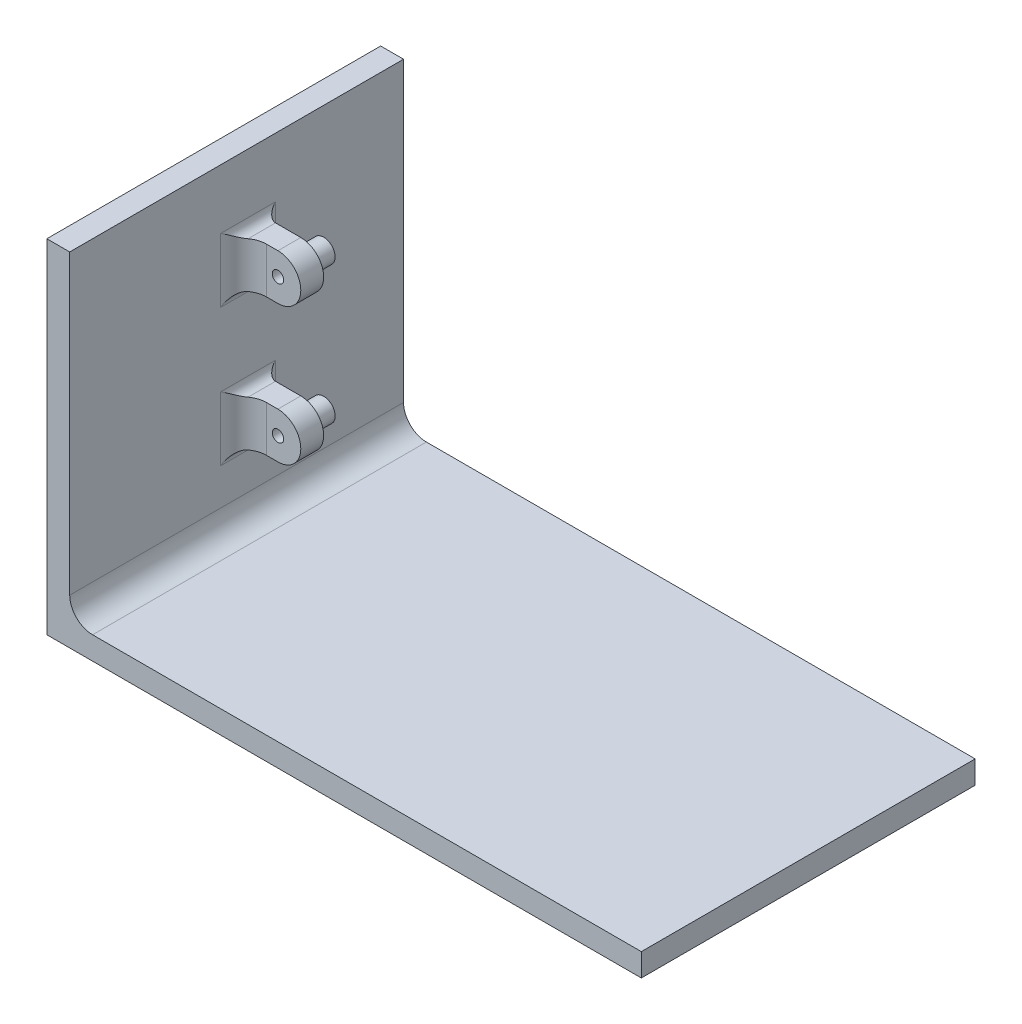
ISO-10303-21;
HEADER;
FILE_DESCRIPTION(('STEP AP214'),'2;1');
FILE_NAME('part.step','',(''),(''),'','','');
FILE_SCHEMA(('AUTOMOTIVE_DESIGN { 1 0 10303 214 1 1 1 1 }'));
ENDSEC;
DATA;
#1=APPLICATION_CONTEXT('core data for automotive mechanical design processes');
#2=APPLICATION_PROTOCOL_DEFINITION('international standard','automotive_design',2000,#1);
#3=PRODUCT_CONTEXT('',#1,'mechanical');
#4=PRODUCT('Part','Part','',(#3));
#5=PRODUCT_RELATED_PRODUCT_CATEGORY('part','',(#4));
#6=PRODUCT_DEFINITION_FORMATION('','',#4);
#7=PRODUCT_DEFINITION_CONTEXT('part definition',#1,'design');
#8=PRODUCT_DEFINITION('design','',#6,#7);
#9=PRODUCT_DEFINITION_SHAPE('','',#8);
#10=(LENGTH_UNIT() NAMED_UNIT(*) SI_UNIT(.MILLI.,.METRE.));
#11=(NAMED_UNIT(*) PLANE_ANGLE_UNIT() SI_UNIT($,.RADIAN.));
#12=(NAMED_UNIT(*) SI_UNIT($,.STERADIAN.) SOLID_ANGLE_UNIT());
#13=UNCERTAINTY_MEASURE_WITH_UNIT(LENGTH_MEASURE(1.E-05),#10,'distance_accuracy_value','');
#14=(GEOMETRIC_REPRESENTATION_CONTEXT(3) GLOBAL_UNCERTAINTY_ASSIGNED_CONTEXT((#13)) GLOBAL_UNIT_ASSIGNED_CONTEXT((#10,
#11,#12)) REPRESENTATION_CONTEXT('',''));
#15=CARTESIAN_POINT('',(0.,0.,0.));
#16=DIRECTION('',(0.,0.,1.));
#17=DIRECTION('',(1.,0.,0.));
#18=AXIS2_PLACEMENT_3D('',#15,#16,#17);
#19=CARTESIAN_POINT('',(0.,0.,73.));
#20=DIRECTION('',(0.,0.,1.));
#21=DIRECTION('',(1.,0.,0.));
#22=AXIS2_PLACEMENT_3D('',#19,#20,#21);
#23=PLANE('',#22);
#24=DIRECTION('',(1.,0.,0.));
#25=VECTOR('',#24,1.);
#26=CARTESIAN_POINT('',(0.,0.,73.));
#27=LINE('',#26,#25);
#28=CARTESIAN_POINT('',(5.,0.,73.));
#29=VERTEX_POINT('',#28);
#30=CARTESIAN_POINT('',(125.,0.,73.));
#31=VERTEX_POINT('',#30);
#32=EDGE_CURVE('E207',#29,#31,#27,.T.);
#33=ORIENTED_EDGE('',*,*,#32,.F.);
#34=CARTESIAN_POINT('',(5.,5.,73.));
#35=DIRECTION('',(0.,0.,1.));
#36=DIRECTION('',(1.,0.,0.));
#37=AXIS2_PLACEMENT_3D('',#34,#35,#36);
#38=CIRCLE('',#37,5.);
#39=CARTESIAN_POINT('',(0.,5.,73.));
#40=VERTEX_POINT('',#39);
#41=EDGE_CURVE('E190',#29,#40,#38,.F.);
#42=ORIENTED_EDGE('',*,*,#41,.T.);
#43=DIRECTION('',(0.,-1.,0.));
#44=VECTOR('',#43,1.);
#45=CARTESIAN_POINT('',(0.,0.,73.));
#46=LINE('',#45,#44);
#47=CARTESIAN_POINT('',(0.,70.,73.));
#48=VERTEX_POINT('',#47);
#49=EDGE_CURVE('E200',#48,#40,#46,.T.);
#50=ORIENTED_EDGE('',*,*,#49,.F.);
#51=DIRECTION('',(-1.,0.,0.));
#52=VECTOR('',#51,1.);
#53=CARTESIAN_POINT('',(0.,70.,73.));
#54=LINE('',#53,#52);
#55=CARTESIAN_POINT('',(-5.,70.,73.));
#56=VERTEX_POINT('',#55);
#57=EDGE_CURVE('E213',#48,#56,#54,.T.);
#58=ORIENTED_EDGE('',*,*,#57,.T.);
#59=DIRECTION('',(0.,-1.,0.));
#60=VECTOR('',#59,1.);
#61=CARTESIAN_POINT('',(-5.,0.,73.));
#62=LINE('',#61,#60);
#63=CARTESIAN_POINT('',(-5.,-5.,73.));
#64=VERTEX_POINT('',#63);
#65=EDGE_CURVE('E218',#56,#64,#62,.T.);
#66=ORIENTED_EDGE('',*,*,#65,.T.);
#67=DIRECTION('',(1.,0.,0.));
#68=VECTOR('',#67,1.);
#69=CARTESIAN_POINT('',(0.,-5.,73.));
#70=LINE('',#69,#68);
#71=CARTESIAN_POINT('',(125.,-4.99999999999998,73.));
#72=VERTEX_POINT('',#71);
#73=EDGE_CURVE('E221',#64,#72,#70,.T.);
#74=ORIENTED_EDGE('',*,*,#73,.T.);
#75=DIRECTION('',(0.,1.,0.));
#76=VECTOR('',#75,1.);
#77=CARTESIAN_POINT('',(125.,0.,73.));
#78=LINE('',#77,#76);
#79=EDGE_CURVE('E211',#72,#31,#78,.T.);
#80=ORIENTED_EDGE('',*,*,#79,.T.);
#81=EDGE_LOOP('',(#33,#42,#50,#58,#66,#74,#80));
#82=FACE_BOUND('',#81,.T.);
#83=ADVANCED_FACE('F40',(#82),#23,.T.);
#84=CARTESIAN_POINT('',(0.,0.,70.));
#85=DIRECTION('',(-1.,0.,0.));
#86=DIRECTION('',(0.,0.,1.));
#87=AXIS2_PLACEMENT_3D('',#84,#85,#86);
#88=PLANE('',#87);
#89=DIRECTION('',(0.,0.,1.));
#90=VECTOR('',#89,1.);
#91=CARTESIAN_POINT('',(0.,43.,70.));
#92=LINE('',#91,#90);
#93=CARTESIAN_POINT('',(0.,43.,28.));
#94=VERTEX_POINT('',#93);
#95=CARTESIAN_POINT('',(0.,43.,40.));
#96=VERTEX_POINT('',#95);
#97=EDGE_CURVE('E348',#94,#96,#92,.T.);
#98=ORIENTED_EDGE('',*,*,#97,.T.);
#99=DIRECTION('',(0.,1.,0.));
#100=VECTOR('',#99,1.);
#101=CARTESIAN_POINT('',(0.,0.,40.));
#102=LINE('',#101,#100);
#103=CARTESIAN_POINT('',(0.,57.,40.));
#104=VERTEX_POINT('',#103);
#105=EDGE_CURVE('E315',#96,#104,#102,.T.);
#106=ORIENTED_EDGE('',*,*,#105,.T.);
#107=DIRECTION('',(0.,0.,1.));
#108=VECTOR('',#107,1.);
#109=CARTESIAN_POINT('',(0.,57.,70.));
#110=LINE('',#109,#108);
#111=CARTESIAN_POINT('',(0.,57.,28.));
#112=VERTEX_POINT('',#111);
#113=EDGE_CURVE('E345',#104,#112,#110,.F.);
#114=ORIENTED_EDGE('',*,*,#113,.T.);
#115=DIRECTION('',(0.,1.,0.));
#116=VECTOR('',#115,1.);
#117=CARTESIAN_POINT('',(0.,45.,28.));
#118=LINE('',#117,#116);
#119=EDGE_CURVE('E335',#112,#94,#118,.F.);
#120=ORIENTED_EDGE('',*,*,#119,.T.);
#121=EDGE_LOOP('',(#98,#106,#114,#120));
#122=FACE_BOUND('',#121,.T.);
#123=DIRECTION('',(0.,1.,0.));
#124=VECTOR('',#123,1.);
#125=CARTESIAN_POINT('',(0.,0.,0.));
#126=LINE('',#125,#124);
#127=CARTESIAN_POINT('',(0.,5.,0.));
#128=VERTEX_POINT('',#127);
#129=CARTESIAN_POINT('',(0.,70.,0.));
#130=VERTEX_POINT('',#129);
#131=EDGE_CURVE('E297',#128,#130,#126,.T.);
#132=ORIENTED_EDGE('',*,*,#131,.T.);
#133=DIRECTION('',(0.,0.,-1.));
#134=VECTOR('',#133,1.);
#135=CARTESIAN_POINT('',(0.,70.,73.));
#136=LINE('',#135,#134);
#137=EDGE_CURVE('E203',#48,#130,#136,.T.);
#138=ORIENTED_EDGE('',*,*,#137,.F.);
#139=ORIENTED_EDGE('',*,*,#49,.T.);
#140=DIRECTION('',(0.,0.,-1.));
#141=VECTOR('',#140,1.);
#142=CARTESIAN_POINT('',(0.,5.,70.));
#143=LINE('',#142,#141);
#144=EDGE_CURVE('E185',#40,#128,#143,.T.);
#145=ORIENTED_EDGE('',*,*,#144,.T.);
#146=EDGE_LOOP('',(#132,#138,#139,#145));
#147=FACE_BOUND('',#146,.T.);
#148=DIRECTION('',(0.,1.,0.));
#149=VECTOR('',#148,1.);
#150=CARTESIAN_POINT('',(0.,0.,40.));
#151=LINE('',#150,#149);
#152=CARTESIAN_POINT('',(0.,13.,40.));
#153=VERTEX_POINT('',#152);
#154=CARTESIAN_POINT('',(0.,27.,40.));
#155=VERTEX_POINT('',#154);
#156=EDGE_CURVE('E317',#153,#155,#151,.T.);
#157=ORIENTED_EDGE('',*,*,#156,.T.);
#158=DIRECTION('',(0.,0.,1.));
#159=VECTOR('',#158,1.);
#160=CARTESIAN_POINT('',(0.,27.,70.));
#161=LINE('',#160,#159);
#162=CARTESIAN_POINT('',(0.,27.,28.));
#163=VERTEX_POINT('',#162);
#164=EDGE_CURVE('E354',#155,#163,#161,.F.);
#165=ORIENTED_EDGE('',*,*,#164,.T.);
#166=DIRECTION('',(0.,1.,0.));
#167=VECTOR('',#166,1.);
#168=CARTESIAN_POINT('',(0.,15.,28.));
#169=LINE('',#168,#167);
#170=CARTESIAN_POINT('',(0.,13.,28.));
#171=VERTEX_POINT('',#170);
#172=EDGE_CURVE('E337',#163,#171,#169,.F.);
#173=ORIENTED_EDGE('',*,*,#172,.T.);
#174=DIRECTION('',(0.,0.,1.));
#175=VECTOR('',#174,1.);
#176=CARTESIAN_POINT('',(0.,13.,70.));
#177=LINE('',#176,#175);
#178=EDGE_CURVE('E351',#171,#153,#177,.T.);
#179=ORIENTED_EDGE('',*,*,#178,.T.);
#180=EDGE_LOOP('',(#157,#165,#173,#179));
#181=FACE_BOUND('',#180,.T.);
#182=ADVANCED_FACE('F201',(#122,#147,#181),#88,.F.);
#183=CARTESIAN_POINT('',(0.,70.,70.));
#184=DIRECTION('',(0.,-1.,0.));
#185=DIRECTION('',(0.,0.,-1.));
#186=AXIS2_PLACEMENT_3D('',#183,#184,#185);
#187=PLANE('',#186);
#188=DIRECTION('',(-1.,0.,0.));
#189=VECTOR('',#188,1.);
#190=CARTESIAN_POINT('',(0.,70.,0.));
#191=LINE('',#190,#189);
#192=CARTESIAN_POINT('',(-5.,70.,0.));
#193=VERTEX_POINT('',#192);
#194=EDGE_CURVE('E301',#130,#193,#191,.T.);
#195=ORIENTED_EDGE('',*,*,#194,.T.);
#196=DIRECTION('',(0.,0.,-1.));
#197=VECTOR('',#196,1.);
#198=CARTESIAN_POINT('',(-5.,70.,70.));
#199=LINE('',#198,#197);
#200=EDGE_CURVE('E305',#56,#193,#199,.T.);
#201=ORIENTED_EDGE('',*,*,#200,.F.);
#202=ORIENTED_EDGE('',*,*,#57,.F.);
#203=ORIENTED_EDGE('',*,*,#137,.T.);
#204=EDGE_LOOP('',(#195,#201,#202,#203));
#205=FACE_BOUND('',#204,.T.);
#206=ADVANCED_FACE('F464',(#205),#187,.F.);
#207=CARTESIAN_POINT('',(-5.,0.,70.));
#208=DIRECTION('',(1.,0.,0.));
#209=DIRECTION('',(0.,0.,-1.));
#210=AXIS2_PLACEMENT_3D('',#207,#208,#209);
#211=PLANE('',#210);
#212=DIRECTION('',(0.,-1.,0.));
#213=VECTOR('',#212,1.);
#214=CARTESIAN_POINT('',(-5.,0.,0.));
#215=LINE('',#214,#213);
#216=CARTESIAN_POINT('',(-5.,-5.,0.));
#217=VERTEX_POINT('',#216);
#218=EDGE_CURVE('E303',#193,#217,#215,.T.);
#219=ORIENTED_EDGE('',*,*,#218,.T.);
#220=DIRECTION('',(0.,0.,-1.));
#221=VECTOR('',#220,1.);
#222=CARTESIAN_POINT('',(-5.,-5.,0.));
#223=LINE('',#222,#221);
#224=EDGE_CURVE('E238',#64,#217,#223,.T.);
#225=ORIENTED_EDGE('',*,*,#224,.F.);
#226=ORIENTED_EDGE('',*,*,#65,.F.);
#227=ORIENTED_EDGE('',*,*,#200,.T.);
#228=EDGE_LOOP('',(#219,#225,#226,#227));
#229=FACE_BOUND('',#228,.T.);
#230=ADVANCED_FACE('F550',(#229),#211,.F.);
#231=CARTESIAN_POINT('',(0.,0.,0.));
#232=DIRECTION('',(0.,0.,1.));
#233=DIRECTION('',(1.,0.,0.));
#234=AXIS2_PLACEMENT_3D('',#231,#232,#233);
#235=PLANE('',#234);
#236=ORIENTED_EDGE('',*,*,#131,.F.);
#237=CARTESIAN_POINT('',(5.,5.,0.));
#238=DIRECTION('',(0.,0.,1.));
#239=DIRECTION('',(1.,0.,0.));
#240=AXIS2_PLACEMENT_3D('',#237,#238,#239);
#241=CIRCLE('',#240,5.);
#242=CARTESIAN_POINT('',(5.,0.,0.));
#243=VERTEX_POINT('',#242);
#244=EDGE_CURVE('E192',#128,#243,#241,.T.);
#245=ORIENTED_EDGE('',*,*,#244,.T.);
#246=DIRECTION('',(1.,0.,0.));
#247=VECTOR('',#246,1.);
#248=CARTESIAN_POINT('',(-5.,0.,0.));
#249=LINE('',#248,#247);
#250=CARTESIAN_POINT('',(125.,0.,0.));
#251=VERTEX_POINT('',#250);
#252=EDGE_CURVE('E237',#243,#251,#249,.T.);
#253=ORIENTED_EDGE('',*,*,#252,.T.);
#254=DIRECTION('',(0.,1.,0.));
#255=VECTOR('',#254,1.);
#256=CARTESIAN_POINT('',(125.,-4.99999999999998,0.));
#257=LINE('',#256,#255);
#258=CARTESIAN_POINT('',(125.,-4.99999999999998,0.));
#259=VERTEX_POINT('',#258);
#260=EDGE_CURVE('E246',#259,#251,#257,.T.);
#261=ORIENTED_EDGE('',*,*,#260,.F.);
#262=DIRECTION('',(1.,0.,0.));
#263=VECTOR('',#262,1.);
#264=CARTESIAN_POINT('',(-5.,-5.,0.));
#265=LINE('',#264,#263);
#266=EDGE_CURVE('E241',#217,#259,#265,.T.);
#267=ORIENTED_EDGE('',*,*,#266,.F.);
#268=ORIENTED_EDGE('',*,*,#218,.F.);
#269=ORIENTED_EDGE('',*,*,#194,.F.);
#270=EDGE_LOOP('',(#236,#245,#253,#261,#267,#268,#269));
#271=FACE_BOUND('',#270,.T.);
#272=ADVANCED_FACE('F554',(#271),#235,.F.);
#273=CARTESIAN_POINT('',(0.,45.,30.));
#274=DIRECTION('',(0.,-1.,0.));
#275=DIRECTION('',(1.,0.,0.));
#276=AXIS2_PLACEMENT_3D('',#273,#274,#275);
#277=PLANE('',#276);
#278=CARTESIAN_POINT('',(5.,45.,40.));
#279=DIRECTION('',(0.,-1.,0.));
#280=DIRECTION('',(1.,0.,0.));
#281=AXIS2_PLACEMENT_3D('',#278,#279,#280);
#282=CIRCLE('',#281,5.);
#283=CARTESIAN_POINT('',(5.,45.,35.));
#284=VERTEX_POINT('',#283);
#285=CARTESIAN_POINT('',(2.,45.,36.));
#286=VERTEX_POINT('',#285);
#287=EDGE_CURVE('E330',#284,#286,#282,.F.);
#288=ORIENTED_EDGE('',*,*,#287,.T.);
#289=DIRECTION('',(0.,0.,1.));
#290=VECTOR('',#289,1.);
#291=CARTESIAN_POINT('',(2.,45.,30.));
#292=LINE('',#291,#290);
#293=CARTESIAN_POINT('',(2.,45.,30.));
#294=VERTEX_POINT('',#293);
#295=EDGE_CURVE('E359',#286,#294,#292,.F.);
#296=ORIENTED_EDGE('',*,*,#295,.T.);
#297=DIRECTION('',(1.,0.,0.));
#298=VECTOR('',#297,1.);
#299=CARTESIAN_POINT('',(0.,45.,30.));
#300=LINE('',#299,#298);
#301=CARTESIAN_POINT('',(7.53161924276528,45.,30.));
#302=VERTEX_POINT('',#301);
#303=EDGE_CURVE('E279',#294,#302,#300,.T.);
#304=ORIENTED_EDGE('',*,*,#303,.T.);
#305=DIRECTION('',(0.,0.,1.));
#306=VECTOR('',#305,1.);
#307=CARTESIAN_POINT('',(7.53161924276528,45.,30.));
#308=LINE('',#307,#306);
#309=CARTESIAN_POINT('',(7.53161924276528,45.,35.));
#310=VERTEX_POINT('',#309);
#311=EDGE_CURVE('E288',#302,#310,#308,.T.);
#312=ORIENTED_EDGE('',*,*,#311,.T.);
#313=DIRECTION('',(1.,0.,0.));
#314=VECTOR('',#313,1.);
#315=CARTESIAN_POINT('',(0.,45.,35.));
#316=LINE('',#315,#314);
#317=EDGE_CURVE('E276',#284,#310,#316,.T.);
#318=ORIENTED_EDGE('',*,*,#317,.F.);
#319=EDGE_LOOP('',(#288,#296,#304,#312,#318));
#320=FACE_BOUND('',#319,.T.);
#321=ADVANCED_FACE('F440',(#320),#277,.T.);
#322=CARTESIAN_POINT('',(0.,55.,30.));
#323=DIRECTION('',(0.,1.,0.));
#324=DIRECTION('',(0.,0.,1.));
#325=AXIS2_PLACEMENT_3D('',#322,#323,#324);
#326=PLANE('',#325);
#327=DIRECTION('',(-1.,0.,0.));
#328=VECTOR('',#327,1.);
#329=CARTESIAN_POINT('',(0.,55.,30.));
#330=LINE('',#329,#328);
#331=CARTESIAN_POINT('',(7.53161924276528,55.,30.));
#332=VERTEX_POINT('',#331);
#333=CARTESIAN_POINT('',(2.,55.,30.));
#334=VERTEX_POINT('',#333);
#335=EDGE_CURVE('E285',#332,#334,#330,.T.);
#336=ORIENTED_EDGE('',*,*,#335,.T.);
#337=DIRECTION('',(0.,0.,1.));
#338=VECTOR('',#337,1.);
#339=CARTESIAN_POINT('',(2.,55.,30.));
#340=LINE('',#339,#338);
#341=CARTESIAN_POINT('',(2.,55.,36.));
#342=VERTEX_POINT('',#341);
#343=EDGE_CURVE('E361',#334,#342,#340,.T.);
#344=ORIENTED_EDGE('',*,*,#343,.T.);
#345=CARTESIAN_POINT('',(5.,55.,40.));
#346=DIRECTION('',(0.,1.,0.));
#347=DIRECTION('',(0.,0.,1.));
#348=AXIS2_PLACEMENT_3D('',#345,#346,#347);
#349=CIRCLE('',#348,5.);
#350=CARTESIAN_POINT('',(5.,55.,35.));
#351=VERTEX_POINT('',#350);
#352=EDGE_CURVE('E328',#342,#351,#349,.F.);
#353=ORIENTED_EDGE('',*,*,#352,.T.);
#354=DIRECTION('',(-1.,0.,0.));
#355=VECTOR('',#354,1.);
#356=CARTESIAN_POINT('',(0.,55.,35.));
#357=LINE('',#356,#355);
#358=CARTESIAN_POINT('',(7.53161924276528,55.,35.));
#359=VERTEX_POINT('',#358);
#360=EDGE_CURVE('E282',#359,#351,#357,.T.);
#361=ORIENTED_EDGE('',*,*,#360,.F.);
#362=DIRECTION('',(0.,0.,1.));
#363=VECTOR('',#362,1.);
#364=CARTESIAN_POINT('',(7.53161924276528,55.,30.));
#365=LINE('',#364,#363);
#366=EDGE_CURVE('E295',#332,#359,#365,.T.);
#367=ORIENTED_EDGE('',*,*,#366,.F.);
#368=EDGE_LOOP('',(#336,#344,#353,#361,#367));
#369=FACE_BOUND('',#368,.T.);
#370=ADVANCED_FACE('F432',(#369),#326,.T.);
#371=CARTESIAN_POINT('',(7.53161924276528,50.,30.));
#372=DIRECTION('',(0.,0.,1.));
#373=DIRECTION('',(1.,0.,0.));
#374=AXIS2_PLACEMENT_3D('',#371,#372,#373);
#375=CYLINDRICAL_SURFACE('',#374,5.);
#376=CARTESIAN_POINT('',(7.53161924276528,50.,35.));
#377=DIRECTION('',(0.,0.,1.));
#378=DIRECTION('',(1.,0.,0.));
#379=AXIS2_PLACEMENT_3D('',#376,#377,#378);
#380=CIRCLE('',#379,5.);
#381=EDGE_CURVE('E290',#310,#359,#380,.T.);
#382=ORIENTED_EDGE('',*,*,#381,.F.);
#383=ORIENTED_EDGE('',*,*,#311,.F.);
#384=CARTESIAN_POINT('',(7.53161924276528,50.,30.));
#385=DIRECTION('',(0.,0.,1.));
#386=DIRECTION('',(1.,0.,0.));
#387=AXIS2_PLACEMENT_3D('',#384,#385,#386);
#388=CIRCLE('',#387,5.);
#389=EDGE_CURVE('E281',#302,#332,#388,.T.);
#390=ORIENTED_EDGE('',*,*,#389,.T.);
#391=ORIENTED_EDGE('',*,*,#366,.T.);
#392=EDGE_LOOP('',(#382,#383,#390,#391));
#393=FACE_BOUND('',#392,.T.);
#394=ADVANCED_FACE('F436',(#393),#375,.T.);
#395=CARTESIAN_POINT('',(0.,0.,30.));
#396=DIRECTION('',(0.,0.,1.));
#397=DIRECTION('',(1.,0.,0.));
#398=AXIS2_PLACEMENT_3D('',#395,#396,#397);
#399=PLANE('',#398);
#400=CARTESIAN_POINT('',(7.54760008189159,50.0613103135772,30.));
#401=DIRECTION('',(0.,0.,1.));
#402=DIRECTION('',(1.,0.,0.));
#403=AXIS2_PLACEMENT_3D('',#400,#401,#402);
#404=CIRCLE('',#403,2.5);
#405=CARTESIAN_POINT('',(10.0476000818916,50.0613103135772,30.));
#406=VERTEX_POINT('',#405);
#407=EDGE_CURVE('E308',#406,#406,#404,.F.);
#408=ORIENTED_EDGE('',*,*,#407,.F.);
#409=EDGE_LOOP('',(#408));
#410=FACE_BOUND('',#409,.T.);
#411=ORIENTED_EDGE('',*,*,#303,.F.);
#412=DIRECTION('',(0.,1.,0.));
#413=VECTOR('',#412,1.);
#414=CARTESIAN_POINT('',(2.,55.,30.));
#415=LINE('',#414,#413);
#416=EDGE_CURVE('E339',#294,#334,#415,.T.);
#417=ORIENTED_EDGE('',*,*,#416,.T.);
#418=ORIENTED_EDGE('',*,*,#335,.F.);
#419=ORIENTED_EDGE('',*,*,#389,.F.);
#420=EDGE_LOOP('',(#411,#417,#418,#419));
#421=FACE_BOUND('',#420,.T.);
#422=ADVANCED_FACE('F429',(#410,#421),#399,.F.);
#423=CARTESIAN_POINT('',(0.,0.,35.));
#424=DIRECTION('',(0.,0.,1.));
#425=DIRECTION('',(1.,0.,0.));
#426=AXIS2_PLACEMENT_3D('',#423,#424,#425);
#427=PLANE('',#426);
#428=CARTESIAN_POINT('',(7.54760008189159,50.0613103135772,35.));
#429=DIRECTION('',(0.,0.,1.));
#430=DIRECTION('',(1.,0.,0.));
#431=AXIS2_PLACEMENT_3D('',#428,#429,#430);
#432=CIRCLE('',#431,1.25);
#433=CARTESIAN_POINT('',(8.79760008189159,50.0613103135772,35.));
#434=VERTEX_POINT('',#433);
#435=EDGE_CURVE('E234',#434,#434,#432,.T.);
#436=ORIENTED_EDGE('',*,*,#435,.F.);
#437=EDGE_LOOP('',(#436));
#438=FACE_BOUND('',#437,.T.);
#439=ORIENTED_EDGE('',*,*,#360,.T.);
#440=DIRECTION('',(0.,1.,0.));
#441=VECTOR('',#440,1.);
#442=CARTESIAN_POINT('',(5.,0.,35.));
#443=LINE('',#442,#441);
#444=EDGE_CURVE('E321',#351,#284,#443,.F.);
#445=ORIENTED_EDGE('',*,*,#444,.T.);
#446=ORIENTED_EDGE('',*,*,#317,.T.);
#447=ORIENTED_EDGE('',*,*,#381,.T.);
#448=EDGE_LOOP('',(#439,#445,#446,#447));
#449=FACE_BOUND('',#448,.T.);
#450=ADVANCED_FACE('F443',(#438,#449),#427,.T.);
#451=CARTESIAN_POINT('',(0.,15.,30.));
#452=DIRECTION('',(0.,-1.,0.));
#453=DIRECTION('',(0.,0.,-1.));
#454=AXIS2_PLACEMENT_3D('',#451,#452,#453);
#455=PLANE('',#454);
#456=CARTESIAN_POINT('',(5.,15.,40.));
#457=DIRECTION('',(0.,-1.,0.));
#458=DIRECTION('',(0.,0.,-1.));
#459=AXIS2_PLACEMENT_3D('',#456,#457,#458);
#460=CIRCLE('',#459,5.);
#461=CARTESIAN_POINT('',(5.,15.,35.));
#462=VERTEX_POINT('',#461);
#463=CARTESIAN_POINT('',(2.,15.,36.));
#464=VERTEX_POINT('',#463);
#465=EDGE_CURVE('E325',#462,#464,#460,.F.);
#466=ORIENTED_EDGE('',*,*,#465,.T.);
#467=DIRECTION('',(0.,0.,1.));
#468=VECTOR('',#467,1.);
#469=CARTESIAN_POINT('',(2.,15.,30.));
#470=LINE('',#469,#468);
#471=CARTESIAN_POINT('',(2.,15.,30.));
#472=VERTEX_POINT('',#471);
#473=EDGE_CURVE('E357',#464,#472,#470,.F.);
#474=ORIENTED_EDGE('',*,*,#473,.T.);
#475=DIRECTION('',(1.,0.,0.));
#476=VECTOR('',#475,1.);
#477=CARTESIAN_POINT('',(0.,15.,30.));
#478=LINE('',#477,#476);
#479=CARTESIAN_POINT('',(7.53161924276528,15.,30.));
#480=VERTEX_POINT('',#479);
#481=EDGE_CURVE('E258',#472,#480,#478,.T.);
#482=ORIENTED_EDGE('',*,*,#481,.T.);
#483=DIRECTION('',(0.,0.,1.));
#484=VECTOR('',#483,1.);
#485=CARTESIAN_POINT('',(7.53161924276528,15.,30.));
#486=LINE('',#485,#484);
#487=CARTESIAN_POINT('',(7.53161924276528,15.,35.));
#488=VERTEX_POINT('',#487);
#489=EDGE_CURVE('E267',#480,#488,#486,.T.);
#490=ORIENTED_EDGE('',*,*,#489,.T.);
#491=DIRECTION('',(1.,0.,0.));
#492=VECTOR('',#491,1.);
#493=CARTESIAN_POINT('',(0.,15.,35.));
#494=LINE('',#493,#492);
#495=EDGE_CURVE('E257',#462,#488,#494,.T.);
#496=ORIENTED_EDGE('',*,*,#495,.F.);
#497=EDGE_LOOP('',(#466,#474,#482,#490,#496));
#498=FACE_BOUND('',#497,.T.);
#499=ADVANCED_FACE('F445',(#498),#455,.T.);
#500=CARTESIAN_POINT('',(0.,25.,30.));
#501=DIRECTION('',(0.,1.,0.));
#502=DIRECTION('',(0.,0.,1.));
#503=AXIS2_PLACEMENT_3D('',#500,#501,#502);
#504=PLANE('',#503);
#505=DIRECTION('',(-1.,0.,0.));
#506=VECTOR('',#505,1.);
#507=CARTESIAN_POINT('',(0.,25.,30.));
#508=LINE('',#507,#506);
#509=CARTESIAN_POINT('',(7.53161924276528,25.,30.));
#510=VERTEX_POINT('',#509);
#511=CARTESIAN_POINT('',(2.,25.,30.));
#512=VERTEX_POINT('',#511);
#513=EDGE_CURVE('E264',#510,#512,#508,.T.);
#514=ORIENTED_EDGE('',*,*,#513,.T.);
#515=DIRECTION('',(0.,0.,1.));
#516=VECTOR('',#515,1.);
#517=CARTESIAN_POINT('',(2.,25.,30.));
#518=LINE('',#517,#516);
#519=CARTESIAN_POINT('',(2.,25.,36.));
#520=VERTEX_POINT('',#519);
#521=EDGE_CURVE('E342',#512,#520,#518,.T.);
#522=ORIENTED_EDGE('',*,*,#521,.T.);
#523=CARTESIAN_POINT('',(5.,25.,40.));
#524=DIRECTION('',(0.,1.,0.));
#525=DIRECTION('',(0.,0.,1.));
#526=AXIS2_PLACEMENT_3D('',#523,#524,#525);
#527=CIRCLE('',#526,5.);
#528=CARTESIAN_POINT('',(5.,25.,35.));
#529=VERTEX_POINT('',#528);
#530=EDGE_CURVE('E323',#520,#529,#527,.F.);
#531=ORIENTED_EDGE('',*,*,#530,.T.);
#532=DIRECTION('',(-1.,0.,0.));
#533=VECTOR('',#532,1.);
#534=CARTESIAN_POINT('',(0.,25.,35.));
#535=LINE('',#534,#533);
#536=CARTESIAN_POINT('',(7.53161924276528,25.,35.));
#537=VERTEX_POINT('',#536);
#538=EDGE_CURVE('E261',#537,#529,#535,.T.);
#539=ORIENTED_EDGE('',*,*,#538,.F.);
#540=DIRECTION('',(0.,0.,1.));
#541=VECTOR('',#540,1.);
#542=CARTESIAN_POINT('',(7.53161924276528,25.,30.));
#543=LINE('',#542,#541);
#544=EDGE_CURVE('E274',#510,#537,#543,.T.);
#545=ORIENTED_EDGE('',*,*,#544,.F.);
#546=EDGE_LOOP('',(#514,#522,#531,#539,#545));
#547=FACE_BOUND('',#546,.T.);
#548=ADVANCED_FACE('F452',(#547),#504,.T.);
#549=CARTESIAN_POINT('',(7.53161924276528,20.,30.));
#550=DIRECTION('',(0.,0.,1.));
#551=DIRECTION('',(1.,0.,0.));
#552=AXIS2_PLACEMENT_3D('',#549,#550,#551);
#553=CYLINDRICAL_SURFACE('',#552,5.);
#554=CARTESIAN_POINT('',(7.53161924276528,20.,35.));
#555=DIRECTION('',(0.,0.,1.));
#556=DIRECTION('',(1.,0.,0.));
#557=AXIS2_PLACEMENT_3D('',#554,#555,#556);
#558=CIRCLE('',#557,5.);
#559=EDGE_CURVE('E269',#488,#537,#558,.T.);
#560=ORIENTED_EDGE('',*,*,#559,.F.);
#561=ORIENTED_EDGE('',*,*,#489,.F.);
#562=CARTESIAN_POINT('',(7.53161924276528,20.,30.));
#563=DIRECTION('',(0.,0.,1.));
#564=DIRECTION('',(1.,0.,0.));
#565=AXIS2_PLACEMENT_3D('',#562,#563,#564);
#566=CIRCLE('',#565,5.);
#567=EDGE_CURVE('E260',#480,#510,#566,.T.);
#568=ORIENTED_EDGE('',*,*,#567,.T.);
#569=ORIENTED_EDGE('',*,*,#544,.T.);
#570=EDGE_LOOP('',(#560,#561,#568,#569));
#571=FACE_BOUND('',#570,.T.);
#572=ADVANCED_FACE('F507',(#571),#553,.T.);
#573=CARTESIAN_POINT('',(0.,0.,30.));
#574=DIRECTION('',(0.,0.,1.));
#575=DIRECTION('',(1.,0.,0.));
#576=AXIS2_PLACEMENT_3D('',#573,#574,#575);
#577=PLANE('',#576);
#578=CARTESIAN_POINT('',(7.54760008189159,19.9397729210258,30.));
#579=DIRECTION('',(0.,0.,1.));
#580=DIRECTION('',(1.,0.,0.));
#581=AXIS2_PLACEMENT_3D('',#578,#579,#580);
#582=CIRCLE('',#581,2.5);
#583=CARTESIAN_POINT('',(10.0476000818916,19.9397729210258,30.));
#584=VERTEX_POINT('',#583);
#585=EDGE_CURVE('E197',#584,#584,#582,.F.);
#586=ORIENTED_EDGE('',*,*,#585,.F.);
#587=EDGE_LOOP('',(#586));
#588=FACE_BOUND('',#587,.T.);
#589=ORIENTED_EDGE('',*,*,#481,.F.);
#590=DIRECTION('',(0.,1.,0.));
#591=VECTOR('',#590,1.);
#592=CARTESIAN_POINT('',(2.,25.,30.));
#593=LINE('',#592,#591);
#594=EDGE_CURVE('E332',#472,#512,#593,.T.);
#595=ORIENTED_EDGE('',*,*,#594,.T.);
#596=ORIENTED_EDGE('',*,*,#513,.F.);
#597=ORIENTED_EDGE('',*,*,#567,.F.);
#598=EDGE_LOOP('',(#589,#595,#596,#597));
#599=FACE_BOUND('',#598,.T.);
#600=ADVANCED_FACE('F504',(#588,#599),#577,.F.);
#601=CARTESIAN_POINT('',(0.,0.,35.));
#602=DIRECTION('',(0.,0.,1.));
#603=DIRECTION('',(1.,0.,0.));
#604=AXIS2_PLACEMENT_3D('',#601,#602,#603);
#605=PLANE('',#604);
#606=CARTESIAN_POINT('',(7.54760008189159,19.9397729210258,35.));
#607=DIRECTION('',(0.,0.,1.));
#608=DIRECTION('',(1.,0.,0.));
#609=AXIS2_PLACEMENT_3D('',#606,#607,#608);
#610=CIRCLE('',#609,1.25);
#611=CARTESIAN_POINT('',(8.79760008189159,19.9397729210258,35.));
#612=VERTEX_POINT('',#611);
#613=EDGE_CURVE('E229',#612,#612,#610,.T.);
#614=ORIENTED_EDGE('',*,*,#613,.F.);
#615=EDGE_LOOP('',(#614));
#616=FACE_BOUND('',#615,.T.);
#617=ORIENTED_EDGE('',*,*,#538,.T.);
#618=DIRECTION('',(0.,1.,0.));
#619=VECTOR('',#618,1.);
#620=CARTESIAN_POINT('',(5.,0.,35.));
#621=LINE('',#620,#619);
#622=EDGE_CURVE('E319',#529,#462,#621,.F.);
#623=ORIENTED_EDGE('',*,*,#622,.T.);
#624=ORIENTED_EDGE('',*,*,#495,.T.);
#625=ORIENTED_EDGE('',*,*,#559,.T.);
#626=EDGE_LOOP('',(#617,#623,#624,#625));
#627=FACE_BOUND('',#626,.T.);
#628=ADVANCED_FACE('F502',(#616,#627),#605,.T.);
#629=CARTESIAN_POINT('',(7.54760008189159,50.0613103135772,25.));
#630=DIRECTION('',(0.,0.,1.));
#631=DIRECTION('',(1.,0.,0.));
#632=AXIS2_PLACEMENT_3D('',#629,#630,#631);
#633=CYLINDRICAL_SURFACE('',#632,2.5);
#634=CARTESIAN_POINT('',(7.54760008189159,50.0613103135772,25.));
#635=DIRECTION('',(0.,0.,-1.));
#636=DIRECTION('',(-1.,0.,0.));
#637=AXIS2_PLACEMENT_3D('',#634,#635,#636);
#638=CIRCLE('',#637,2.5);
#639=CARTESIAN_POINT('',(5.04760008189159,50.0613103135772,25.));
#640=VERTEX_POINT('',#639);
#641=EDGE_CURVE('E254',#640,#640,#638,.T.);
#642=ORIENTED_EDGE('',*,*,#641,.F.);
#643=EDGE_LOOP('',(#642));
#644=FACE_BOUND('',#643,.T.);
#645=ORIENTED_EDGE('',*,*,#407,.T.);
#646=EDGE_LOOP('',(#645));
#647=FACE_BOUND('',#646,.T.);
#648=ADVANCED_FACE('F498',(#644,#647),#633,.T.);
#649=CARTESIAN_POINT('',(7.54760008189159,50.0613103135772,25.));
#650=DIRECTION('',(0.,0.,-1.));
#651=DIRECTION('',(-1.,0.,0.));
#652=AXIS2_PLACEMENT_3D('',#649,#650,#651);
#653=PLANE('',#652);
#654=CARTESIAN_POINT('',(7.54760008189159,50.0613103135772,25.));
#655=DIRECTION('',(0.,0.,-1.));
#656=DIRECTION('',(-1.,0.,0.));
#657=AXIS2_PLACEMENT_3D('',#654,#655,#656);
#658=CIRCLE('',#657,1.25);
#659=CARTESIAN_POINT('',(6.29760008189159,50.0613103135772,25.));
#660=VERTEX_POINT('',#659);
#661=EDGE_CURVE('E226',#660,#660,#658,.T.);
#662=ORIENTED_EDGE('',*,*,#661,.F.);
#663=EDGE_LOOP('',(#662));
#664=FACE_BOUND('',#663,.T.);
#665=ORIENTED_EDGE('',*,*,#641,.T.);
#666=EDGE_LOOP('',(#665));
#667=FACE_BOUND('',#666,.T.);
#668=ADVANCED_FACE('F494',(#664,#667),#653,.T.);
#669=CARTESIAN_POINT('',(7.54760008189159,19.9397729210258,25.));
#670=DIRECTION('',(0.,0.,1.));
#671=DIRECTION('',(1.,0.,0.));
#672=AXIS2_PLACEMENT_3D('',#669,#670,#671);
#673=CYLINDRICAL_SURFACE('',#672,2.5);
#674=CARTESIAN_POINT('',(7.54760008189159,19.9397729210258,25.));
#675=DIRECTION('',(0.,0.,-1.));
#676=DIRECTION('',(-1.,0.,0.));
#677=AXIS2_PLACEMENT_3D('',#674,#675,#676);
#678=CIRCLE('',#677,2.5);
#679=CARTESIAN_POINT('',(5.04760008189159,19.9397729210258,25.));
#680=VERTEX_POINT('',#679);
#681=EDGE_CURVE('E251',#680,#680,#678,.T.);
#682=ORIENTED_EDGE('',*,*,#681,.F.);
#683=EDGE_LOOP('',(#682));
#684=FACE_BOUND('',#683,.T.);
#685=ORIENTED_EDGE('',*,*,#585,.T.);
#686=EDGE_LOOP('',(#685));
#687=FACE_BOUND('',#686,.T.);
#688=ADVANCED_FACE('F490',(#684,#687),#673,.T.);
#689=CARTESIAN_POINT('',(7.54760008189159,19.9397729210258,25.));
#690=DIRECTION('',(0.,0.,-1.));
#691=DIRECTION('',(-1.,0.,0.));
#692=AXIS2_PLACEMENT_3D('',#689,#690,#691);
#693=PLANE('',#692);
#694=CARTESIAN_POINT('',(7.54760008189159,19.9397729210258,25.));
#695=DIRECTION('',(0.,0.,-1.));
#696=DIRECTION('',(-1.,0.,0.));
#697=AXIS2_PLACEMENT_3D('',#694,#695,#696);
#698=CIRCLE('',#697,1.25);
#699=CARTESIAN_POINT('',(6.29760008189159,19.9397729210258,25.));
#700=VERTEX_POINT('',#699);
#701=EDGE_CURVE('E225',#700,#700,#698,.T.);
#702=ORIENTED_EDGE('',*,*,#701,.F.);
#703=EDGE_LOOP('',(#702));
#704=FACE_BOUND('',#703,.T.);
#705=ORIENTED_EDGE('',*,*,#681,.T.);
#706=EDGE_LOOP('',(#705));
#707=FACE_BOUND('',#706,.T.);
#708=ADVANCED_FACE('F483',(#704,#707),#693,.T.);
#709=CARTESIAN_POINT('',(0.,0.,0.));
#710=DIRECTION('',(0.,1.,0.));
#711=DIRECTION('',(-1.,0.,0.));
#712=AXIS2_PLACEMENT_3D('',#709,#710,#711);
#713=PLANE('',#712);
#714=ORIENTED_EDGE('',*,*,#252,.F.);
#715=DIRECTION('',(0.,0.,-1.));
#716=VECTOR('',#715,1.);
#717=CARTESIAN_POINT('',(5.,0.,0.));
#718=LINE('',#717,#716);
#719=EDGE_CURVE('E196',#243,#29,#718,.F.);
#720=ORIENTED_EDGE('',*,*,#719,.T.);
#721=ORIENTED_EDGE('',*,*,#32,.T.);
#722=DIRECTION('',(0.,0.,1.));
#723=VECTOR('',#722,1.);
#724=CARTESIAN_POINT('',(125.,0.,0.));
#725=LINE('',#724,#723);
#726=EDGE_CURVE('E242',#251,#31,#725,.T.);
#727=ORIENTED_EDGE('',*,*,#726,.F.);
#728=EDGE_LOOP('',(#714,#720,#721,#727));
#729=FACE_BOUND('',#728,.T.);
#730=ADVANCED_FACE('F480',(#729),#713,.T.);
#731=CARTESIAN_POINT('',(125.,-4.99999999999998,0.));
#732=DIRECTION('',(-1.,0.,0.));
#733=DIRECTION('',(0.,-1.,0.));
#734=AXIS2_PLACEMENT_3D('',#731,#732,#733);
#735=PLANE('',#734);
#736=ORIENTED_EDGE('',*,*,#726,.T.);
#737=ORIENTED_EDGE('',*,*,#79,.F.);
#738=DIRECTION('',(0.,0.,1.));
#739=VECTOR('',#738,1.);
#740=CARTESIAN_POINT('',(125.,-4.99999999999998,0.));
#741=LINE('',#740,#739);
#742=EDGE_CURVE('E244',#259,#72,#741,.T.);
#743=ORIENTED_EDGE('',*,*,#742,.F.);
#744=ORIENTED_EDGE('',*,*,#260,.T.);
#745=EDGE_LOOP('',(#736,#737,#743,#744));
#746=FACE_BOUND('',#745,.T.);
#747=ADVANCED_FACE('F478',(#746),#735,.F.);
#748=CARTESIAN_POINT('',(0.,-5.,0.));
#749=DIRECTION('',(0.,1.,0.));
#750=DIRECTION('',(-1.,0.,0.));
#751=AXIS2_PLACEMENT_3D('',#748,#749,#750);
#752=PLANE('',#751);
#753=ORIENTED_EDGE('',*,*,#224,.T.);
#754=ORIENTED_EDGE('',*,*,#266,.T.);
#755=ORIENTED_EDGE('',*,*,#742,.T.);
#756=ORIENTED_EDGE('',*,*,#73,.F.);
#757=EDGE_LOOP('',(#753,#754,#755,#756));
#758=FACE_BOUND('',#757,.T.);
#759=ADVANCED_FACE('F474',(#758),#752,.F.);
#760=CARTESIAN_POINT('',(7.54760008189159,19.9397729210258,70.));
#761=DIRECTION('',(0.,0.,-1.));
#762=DIRECTION('',(-1.,0.,0.));
#763=AXIS2_PLACEMENT_3D('',#760,#761,#762);
#764=CYLINDRICAL_SURFACE('',#763,1.25);
#765=ORIENTED_EDGE('',*,*,#613,.T.);
#766=EDGE_LOOP('',(#765));
#767=FACE_BOUND('',#766,.T.);
#768=ORIENTED_EDGE('',*,*,#701,.T.);
#769=EDGE_LOOP('',(#768));
#770=FACE_BOUND('',#769,.T.);
#771=ADVANCED_FACE('F470',(#767,#770),#764,.F.);
#772=CARTESIAN_POINT('',(7.54760008189159,50.0613103135772,70.));
#773=DIRECTION('',(0.,0.,-1.));
#774=DIRECTION('',(-1.,0.,0.));
#775=AXIS2_PLACEMENT_3D('',#772,#773,#774);
#776=CYLINDRICAL_SURFACE('',#775,1.25);
#777=ORIENTED_EDGE('',*,*,#435,.T.);
#778=EDGE_LOOP('',(#777));
#779=FACE_BOUND('',#778,.T.);
#780=ORIENTED_EDGE('',*,*,#661,.T.);
#781=EDGE_LOOP('',(#780));
#782=FACE_BOUND('',#781,.T.);
#783=ADVANCED_FACE('F467',(#779,#782),#776,.F.);
#784=CARTESIAN_POINT('',(5.,5.,70.));
#785=DIRECTION('',(0.,0.,-1.));
#786=DIRECTION('',(-1.,0.,0.));
#787=AXIS2_PLACEMENT_3D('',#784,#785,#786);
#788=CYLINDRICAL_SURFACE('',#787,5.);
#789=ORIENTED_EDGE('',*,*,#144,.F.);
#790=ORIENTED_EDGE('',*,*,#41,.F.);
#791=ORIENTED_EDGE('',*,*,#719,.F.);
#792=ORIENTED_EDGE('',*,*,#244,.F.);
#793=EDGE_LOOP('',(#789,#790,#791,#792));
#794=FACE_BOUND('',#793,.T.);
#795=ADVANCED_FACE('F187',(#794),#788,.F.);
#796=CARTESIAN_POINT('',(5.,0.,40.));
#797=DIRECTION('',(0.,1.,0.));
#798=DIRECTION('',(0.,0.,1.));
#799=AXIS2_PLACEMENT_3D('',#796,#797,#798);
#800=CYLINDRICAL_SURFACE('',#799,5.);
#801=ORIENTED_EDGE('',*,*,#465,.F.);
#802=ORIENTED_EDGE('',*,*,#622,.F.);
#803=ORIENTED_EDGE('',*,*,#530,.F.);
#804=CARTESIAN_POINT('',(2.,25.,36.));
#805=CARTESIAN_POINT('',(1.93158584431926,25.0000067597266,36.051291938938));
#806=CARTESIAN_POINT('',(1.86455821852766,25.0035084279663,36.1043221905044));
#807=CARTESIAN_POINT('',(1.73376301953583,25.0167109029042,36.2133273103346));
#808=CARTESIAN_POINT('',(1.6699900118235,25.0264009844002,36.2692969306262));
#809=CARTESIAN_POINT('',(1.5465415072405,25.0510771872825,36.3832847643709));
#810=CARTESIAN_POINT('',(1.48683282305513,25.0660120904686,36.4412784471596));
#811=CARTESIAN_POINT('',(1.37100202672923,25.1005222748414,36.5594732382407));
#812=CARTESIAN_POINT('',(1.3148820435623,25.1201002786803,36.6196756241122));
#813=CARTESIAN_POINT('',(1.18332284605752,25.1724441490579,36.7678914380319));
#814=CARTESIAN_POINT('',(1.10978618138673,25.2072814247064,36.8568697936609));
#815=CARTESIAN_POINT('',(0.970294307628863,25.2836005848064,37.0378149034013));
#816=CARTESIAN_POINT('',(0.904340989331189,25.325084120255,37.1297823955072));
#817=CARTESIAN_POINT('',(0.716973301253284,25.4581112195822,37.4103256805349));
#818=CARTESIAN_POINT('',(0.606831849482495,25.5578938926857,37.6026488108276));
#819=CARTESIAN_POINT('',(0.443284849854599,25.7402635992436,37.9360068086879));
#820=CARTESIAN_POINT('',(0.382705445541229,25.8193534892754,38.0756041550304));
#821=CARTESIAN_POINT('',(0.275222850353248,25.982793757942,38.3570864580454));
#822=CARTESIAN_POINT('',(0.228325682510778,26.0671464335245,38.4989723932581));
#823=CARTESIAN_POINT('',(0.147875885213618,26.2393114336602,38.7839512736836));
#824=CARTESIAN_POINT('',(0.114295694698611,26.32711619508,38.9270410934601));
#825=CARTESIAN_POINT('',(0.0599857310581931,26.5050321913333,39.2141274184524));
#826=CARTESIAN_POINT('',(0.039251846105231,26.5951426785272,39.3581236186325));
#827=CARTESIAN_POINT('',(0.00865251719646451,26.7875547856836,39.6640741180214));
#828=CARTESIAN_POINT('',(0.00040130739056854,26.8900148896172,39.8260977799985));
#829=CARTESIAN_POINT('',(4.76459274936284E-06,26.9949605023191,39.9920318535131));
#830=CARTESIAN_POINT('',(2.95223294540339E-09,26.9974802675754,39.9960159521504));
#831=CARTESIAN_POINT('',(0.,27.,40.));
#832=B_SPLINE_CURVE_WITH_KNOTS('',3,(#804,#805,#806,#807,#808,#809,#810,#811,#812,#813,#814,
#815,#816,#817,#818,#819,#820,#821,#822,#823,#824,#825,#826,#827,#828,#829,#830,#831),
.UNSPECIFIED.,.F.,.F.,(4,2,2,2,2,2,2,2,2,2,2,2,2,4),(0.,0.256323586120897,0.512204136350989,
0.765652360303715,1.01924957198093,1.38041574025907,1.74167176531562,2.46784096790538,
2.98178501814792,3.49595497056349,4.00905516339231,4.5219910388693,5.09684964624113,
5.11099178908029),.UNSPECIFIED.);
#833=EDGE_CURVE('E363',#520,#155,#832,.T.);
#834=ORIENTED_EDGE('',*,*,#833,.T.);
#835=ORIENTED_EDGE('',*,*,#156,.F.);
#836=CARTESIAN_POINT('',(2.,15.,36.));
#837=CARTESIAN_POINT('',(1.93158584431927,14.9999932402734,36.0512919389379));
#838=CARTESIAN_POINT('',(1.86455821852767,14.9964915720337,36.1043221905044));
#839=CARTESIAN_POINT('',(1.73376301953585,14.9832890970958,36.2133273103346));
#840=CARTESIAN_POINT('',(1.66999001182353,14.9735990155998,36.2692969306262));
#841=CARTESIAN_POINT('',(1.54654150724053,14.9489228127175,36.3832847643709));
#842=CARTESIAN_POINT('',(1.48683282305515,14.9339879095314,36.4412784471596));
#843=CARTESIAN_POINT('',(1.37100202672924,14.8994777251586,36.5594732382407));
#844=CARTESIAN_POINT('',(1.3148820435623,14.8798997213197,36.6196756241122));
#845=CARTESIAN_POINT('',(1.18332284605751,14.8275558509421,36.7678914380319));
#846=CARTESIAN_POINT('',(1.10978618138672,14.7927185752936,36.8568697936609));
#847=CARTESIAN_POINT('',(0.970294307628846,14.7163994151936,37.0378149034013));
#848=CARTESIAN_POINT('',(0.904340989331169,14.674915879745,37.1297823955072));
#849=CARTESIAN_POINT('',(0.716973301253272,14.5418887804178,37.4103256805349));
#850=CARTESIAN_POINT('',(0.60683184948249,14.4421061073143,37.6026488108277));
#851=CARTESIAN_POINT('',(0.443284849854601,14.2597364007564,37.9360068086879));
#852=CARTESIAN_POINT('',(0.382705445541232,14.1806465107246,38.0756041550304));
#853=CARTESIAN_POINT('',(0.275222850353255,14.017206242058,38.3570864580454));
#854=CARTESIAN_POINT('',(0.228325682510786,13.9328535664755,38.4989723932581));
#855=CARTESIAN_POINT('',(0.147875885213624,13.7606885663398,38.7839512736836));
#856=CARTESIAN_POINT('',(0.114295694698616,13.6728838049202,38.9270410934602));
#857=CARTESIAN_POINT('',(0.0599857310581945,13.4949678086666,39.2141274184523));
#858=CARTESIAN_POINT('',(0.0392518461052303,13.4048573214723,39.3581236186322));
#859=CARTESIAN_POINT('',(0.00865251719646628,13.212445214317,39.6640741180217));
#860=CARTESIAN_POINT('',(0.000401307390575385,13.1099851103851,39.8260977799999));
#861=CARTESIAN_POINT('',(4.76459274969769E-06,13.005039497681,39.9920318535132));
#862=CARTESIAN_POINT('',(2.95223311700323E-09,13.0025197324246,39.9960159521505));
#863=CARTESIAN_POINT('',(0.,13.,40.));
#864=B_SPLINE_CURVE_WITH_KNOTS('',3,(#836,#837,#838,#839,#840,#841,#842,#843,#844,#845,#846,
#847,#848,#849,#850,#851,#852,#853,#854,#855,#856,#857,#858,#859,#860,#861,#862,#863),
.UNSPECIFIED.,.F.,.F.,(4,2,2,2,2,2,2,2,2,2,2,2,2,4),(0.,0.256323586120875,0.512204136350947,
0.765652360303694,1.01924957198093,1.38041574025909,1.74167176531567,2.46784096790538,
2.98178501814791,3.49595497056345,4.00905516339229,4.52199103886929,5.09684964624113,
5.11099178908029),.UNSPECIFIED.);
#865=EDGE_CURVE('E392',#153,#464,#864,.F.);
#866=ORIENTED_EDGE('',*,*,#865,.T.);
#867=EDGE_LOOP('',(#801,#802,#803,#834,#835,#866));
#868=FACE_BOUND('',#867,.T.);
#869=ADVANCED_FACE('F374',(#868),#800,.F.);
#870=CARTESIAN_POINT('',(5.,0.,40.));
#871=DIRECTION('',(0.,1.,0.));
#872=DIRECTION('',(0.,0.,1.));
#873=AXIS2_PLACEMENT_3D('',#870,#871,#872);
#874=CYLINDRICAL_SURFACE('',#873,5.);
#875=ORIENTED_EDGE('',*,*,#287,.F.);
#876=ORIENTED_EDGE('',*,*,#444,.F.);
#877=ORIENTED_EDGE('',*,*,#352,.F.);
#878=CARTESIAN_POINT('',(2.,55.,36.));
#879=CARTESIAN_POINT('',(1.93158584431927,55.0000067597266,36.0512919389379));
#880=CARTESIAN_POINT('',(1.86455821852767,55.0035084279663,36.1043221905044));
#881=CARTESIAN_POINT('',(1.73376301953586,55.0167109029042,36.2133273103345));
#882=CARTESIAN_POINT('',(1.66999001182354,55.0264009844002,36.2692969306262));
#883=CARTESIAN_POINT('',(1.54654150724054,55.0510771872825,36.3832847643709));
#884=CARTESIAN_POINT('',(1.48683282305516,55.0660120904686,36.4412784471596));
#885=CARTESIAN_POINT('',(1.37100202672924,55.1005222748414,36.5594732382407));
#886=CARTESIAN_POINT('',(1.3148820435623,55.1201002786803,36.6196756241122));
#887=CARTESIAN_POINT('',(1.18332284605751,55.1724441490579,36.7678914380319));
#888=CARTESIAN_POINT('',(1.10978618138671,55.2072814247064,36.856869793661));
#889=CARTESIAN_POINT('',(0.970294307628836,55.2836005848064,37.0378149034013));
#890=CARTESIAN_POINT('',(0.90434098933116,55.325084120255,37.1297823955072));
#891=CARTESIAN_POINT('',(0.716973301253269,55.4581112195822,37.4103256805349));
#892=CARTESIAN_POINT('',(0.60683184948249,55.5578938926857,37.6026488108276));
#893=CARTESIAN_POINT('',(0.443284849854604,55.7402635992436,37.9360068086879));
#894=CARTESIAN_POINT('',(0.382705445541237,55.8193534892754,38.0756041550304));
#895=CARTESIAN_POINT('',(0.27522285035326,55.982793757942,38.3570864580454));
#896=CARTESIAN_POINT('',(0.228325682510793,56.0671464335245,38.4989723932581));
#897=CARTESIAN_POINT('',(0.14787588521363,56.2393114336601,38.7839512736835));
#898=CARTESIAN_POINT('',(0.114295694698621,56.3271161950797,38.9270410934602));
#899=CARTESIAN_POINT('',(0.0599857310581971,56.5050321913334,39.2141274184522));
#900=CARTESIAN_POINT('',(0.0392518461052321,56.5951426785279,39.3581236186321));
#901=CARTESIAN_POINT('',(0.00865251719646588,56.7875547856827,39.6640741180219));
#902=CARTESIAN_POINT('',(0.000401307390573569,56.890014889614,39.8260977800005));
#903=CARTESIAN_POINT('',(4.76459274960865E-06,56.994960502319,39.9920318535132));
#904=CARTESIAN_POINT('',(2.95223307131553E-09,56.9974802675754,39.9960159521505));
#905=CARTESIAN_POINT('',(0.,57.,40.));
#906=B_SPLINE_CURVE_WITH_KNOTS('',3,(#878,#879,#880,#881,#882,#883,#884,#885,#886,#887,#888,
#889,#890,#891,#892,#893,#894,#895,#896,#897,#898,#899,#900,#901,#902,#903,#904,#905),
.UNSPECIFIED.,.F.,.F.,(4,2,2,2,2,2,2,2,2,2,2,2,2,4),(0.,0.256323586120871,0.512204136350927,
0.765652360303686,1.01924957198093,1.38041574025911,1.74167176531569,2.46784096790537,
2.98178501814789,3.49595497056342,4.00905516339227,4.52199103886928,5.09684964624113,
5.11099178908029),.UNSPECIFIED.);
#907=EDGE_CURVE('E49',#342,#104,#906,.T.);
#908=ORIENTED_EDGE('',*,*,#907,.T.);
#909=ORIENTED_EDGE('',*,*,#105,.F.);
#910=CARTESIAN_POINT('',(2.,45.,36.));
#911=CARTESIAN_POINT('',(1.93158584431926,44.9999932402734,36.051291938938));
#912=CARTESIAN_POINT('',(1.86455821852766,44.9964915720337,36.1043221905044));
#913=CARTESIAN_POINT('',(1.73376301953583,44.9832890970958,36.2133273103346));
#914=CARTESIAN_POINT('',(1.6699900118235,44.9735990155998,36.2692969306262));
#915=CARTESIAN_POINT('',(1.5465415072405,44.9489228127175,36.3832847643709));
#916=CARTESIAN_POINT('',(1.48683282305513,44.9339879095314,36.4412784471596));
#917=CARTESIAN_POINT('',(1.37100202672923,44.8994777251586,36.5594732382407));
#918=CARTESIAN_POINT('',(1.3148820435623,44.8798997213197,36.6196756241122));
#919=CARTESIAN_POINT('',(1.18332284605751,44.8275558509421,36.7678914380319));
#920=CARTESIAN_POINT('',(1.10978618138672,44.7927185752936,36.8568697936609));
#921=CARTESIAN_POINT('',(0.970294307628857,44.7163994151936,37.0378149034013));
#922=CARTESIAN_POINT('',(0.904340989331182,44.674915879745,37.1297823955072));
#923=CARTESIAN_POINT('',(0.716973301253279,44.5418887804178,37.4103256805349));
#924=CARTESIAN_POINT('',(0.606831849482496,44.4421061073143,37.6026488108276));
#925=CARTESIAN_POINT('',(0.443284849854604,44.2597364007564,37.9360068086879));
#926=CARTESIAN_POINT('',(0.382705445541233,44.1806465107246,38.0756041550304));
#927=CARTESIAN_POINT('',(0.275222850353252,44.017206242058,38.3570864580454));
#928=CARTESIAN_POINT('',(0.228325682510781,43.9328535664755,38.4989723932581));
#929=CARTESIAN_POINT('',(0.147875885213619,43.7606885663398,38.7839512736836));
#930=CARTESIAN_POINT('',(0.114295694698612,43.67288380492,38.9270410934601));
#931=CARTESIAN_POINT('',(0.0599857310581942,43.4949678086667,39.2141274184524));
#932=CARTESIAN_POINT('',(0.0392518461052321,43.4048573214728,39.3581236186325));
#933=CARTESIAN_POINT('',(0.00865251719646535,43.2124452143165,39.6640741180214));
#934=CARTESIAN_POINT('',(0.000401307390569356,43.109985110383,39.8260977799986));
#935=CARTESIAN_POINT('',(4.76459274940049E-06,43.0050394976809,39.9920318535131));
#936=CARTESIAN_POINT('',(2.95223296396101E-09,43.0025197324246,39.9960159521504));
#937=CARTESIAN_POINT('',(0.,43.,40.));
#938=B_SPLINE_CURVE_WITH_KNOTS('',3,(#910,#911,#912,#913,#914,#915,#916,#917,#918,#919,#920,
#921,#922,#923,#924,#925,#926,#927,#928,#929,#930,#931,#932,#933,#934,#935,#936,#937),
.UNSPECIFIED.,.F.,.F.,(4,2,2,2,2,2,2,2,2,2,2,2,2,4),(0.,0.256323586120896,0.512204136350987,
0.765652360303713,1.01924957198093,1.38041574025908,1.74167176531564,2.46784096790537,
2.9817850181479,3.49595497056347,4.0090551633923,4.52199103886929,5.09684964624112,
5.11099178908029),.UNSPECIFIED.);
#939=EDGE_CURVE('E63',#96,#286,#938,.F.);
#940=ORIENTED_EDGE('',*,*,#939,.T.);
#941=EDGE_LOOP('',(#875,#876,#877,#908,#909,#940));
#942=FACE_BOUND('',#941,.T.);
#943=ADVANCED_FACE('F407',(#942),#874,.F.);
#944=CARTESIAN_POINT('',(2.,0.,28.));
#945=DIRECTION('',(0.,-1.,0.));
#946=DIRECTION('',(0.,0.,-1.));
#947=AXIS2_PLACEMENT_3D('',#944,#945,#946);
#948=CYLINDRICAL_SURFACE('',#947,2.);
#949=ORIENTED_EDGE('',*,*,#594,.F.);
#950=CARTESIAN_POINT('',(2.,13.,28.));
#951=DIRECTION('',(0.,-0.707106781186547,0.707106781186547));
#952=DIRECTION('',(0.,-0.707106781186547,-0.707106781186547));
#953=AXIS2_PLACEMENT_3D('',#950,#951,#952);
#954=ELLIPSE('',#953,2.82842712474619,2.);
#955=EDGE_CURVE('E398',#472,#171,#954,.T.);
#956=ORIENTED_EDGE('',*,*,#955,.T.);
#957=ORIENTED_EDGE('',*,*,#172,.F.);
#958=CARTESIAN_POINT('',(2.,27.,28.));
#959=DIRECTION('',(0.,-0.707106781186547,-0.707106781186547));
#960=DIRECTION('',(0.,-0.707106781186547,0.707106781186547));
#961=AXIS2_PLACEMENT_3D('',#958,#959,#960);
#962=ELLIPSE('',#961,2.82842712474619,2.);
#963=EDGE_CURVE('E372',#163,#512,#962,.F.);
#964=ORIENTED_EDGE('',*,*,#963,.T.);
#965=EDGE_LOOP('',(#949,#956,#957,#964));
#966=FACE_BOUND('',#965,.T.);
#967=ADVANCED_FACE('F410',(#966),#948,.F.);
#968=CARTESIAN_POINT('',(2.,0.,28.));
#969=DIRECTION('',(0.,-1.,0.));
#970=DIRECTION('',(0.,0.,-1.));
#971=AXIS2_PLACEMENT_3D('',#968,#969,#970);
#972=CYLINDRICAL_SURFACE('',#971,2.);
#973=ORIENTED_EDGE('',*,*,#416,.F.);
#974=CARTESIAN_POINT('',(2.,43.,28.));
#975=DIRECTION('',(0.,-0.707106781186547,0.707106781186547));
#976=DIRECTION('',(0.,-0.707106781186547,-0.707106781186547));
#977=AXIS2_PLACEMENT_3D('',#974,#975,#976);
#978=ELLIPSE('',#977,2.82842712474619,2.);
#979=EDGE_CURVE('E406',#294,#94,#978,.T.);
#980=ORIENTED_EDGE('',*,*,#979,.T.);
#981=ORIENTED_EDGE('',*,*,#119,.F.);
#982=CARTESIAN_POINT('',(2.,57.,28.));
#983=DIRECTION('',(0.,-0.707106781186547,-0.707106781186547));
#984=DIRECTION('',(0.,-0.707106781186547,0.707106781186547));
#985=AXIS2_PLACEMENT_3D('',#982,#983,#984);
#986=ELLIPSE('',#985,2.82842712474619,2.);
#987=EDGE_CURVE('E11',#112,#334,#986,.F.);
#988=ORIENTED_EDGE('',*,*,#987,.T.);
#989=EDGE_LOOP('',(#973,#980,#981,#988));
#990=FACE_BOUND('',#989,.T.);
#991=ADVANCED_FACE('F384',(#990),#972,.F.);
#992=CARTESIAN_POINT('',(2.,27.,30.));
#993=DIRECTION('',(0.,0.,1.));
#994=DIRECTION('',(1.,0.,0.));
#995=AXIS2_PLACEMENT_3D('',#992,#993,#994);
#996=CYLINDRICAL_SURFACE('',#995,2.);
#997=ORIENTED_EDGE('',*,*,#963,.F.);
#998=ORIENTED_EDGE('',*,*,#164,.F.);
#999=ORIENTED_EDGE('',*,*,#833,.F.);
#1000=ORIENTED_EDGE('',*,*,#521,.F.);
#1001=EDGE_LOOP('',(#997,#998,#999,#1000));
#1002=FACE_BOUND('',#1001,.T.);
#1003=ADVANCED_FACE('F378',(#1002),#996,.F.);
#1004=CARTESIAN_POINT('',(2.,13.,70.));
#1005=DIRECTION('',(0.,0.,1.));
#1006=DIRECTION('',(1.,0.,0.));
#1007=AXIS2_PLACEMENT_3D('',#1004,#1005,#1006);
#1008=CYLINDRICAL_SURFACE('',#1007,2.);
#1009=ORIENTED_EDGE('',*,*,#955,.F.);
#1010=ORIENTED_EDGE('',*,*,#473,.F.);
#1011=ORIENTED_EDGE('',*,*,#865,.F.);
#1012=ORIENTED_EDGE('',*,*,#178,.F.);
#1013=EDGE_LOOP('',(#1009,#1010,#1011,#1012));
#1014=FACE_BOUND('',#1013,.T.);
#1015=ADVANCED_FACE('F383',(#1014),#1008,.F.);
#1016=CARTESIAN_POINT('',(2.,43.,70.));
#1017=DIRECTION('',(0.,0.,1.));
#1018=DIRECTION('',(1.,0.,0.));
#1019=AXIS2_PLACEMENT_3D('',#1016,#1017,#1018);
#1020=CYLINDRICAL_SURFACE('',#1019,2.);
#1021=ORIENTED_EDGE('',*,*,#979,.F.);
#1022=ORIENTED_EDGE('',*,*,#295,.F.);
#1023=ORIENTED_EDGE('',*,*,#939,.F.);
#1024=ORIENTED_EDGE('',*,*,#97,.F.);
#1025=EDGE_LOOP('',(#1021,#1022,#1023,#1024));
#1026=FACE_BOUND('',#1025,.T.);
#1027=ADVANCED_FACE('F389',(#1026),#1020,.F.);
#1028=CARTESIAN_POINT('',(2.,57.,30.));
#1029=DIRECTION('',(0.,0.,1.));
#1030=DIRECTION('',(1.,0.,0.));
#1031=AXIS2_PLACEMENT_3D('',#1028,#1029,#1030);
#1032=CYLINDRICAL_SURFACE('',#1031,2.);
#1033=ORIENTED_EDGE('',*,*,#987,.F.);
#1034=ORIENTED_EDGE('',*,*,#113,.F.);
#1035=ORIENTED_EDGE('',*,*,#907,.F.);
#1036=ORIENTED_EDGE('',*,*,#343,.F.);
#1037=EDGE_LOOP('',(#1033,#1034,#1035,#1036));
#1038=FACE_BOUND('',#1037,.T.);
#1039=ADVANCED_FACE('F42',(#1038),#1032,.F.);
#1040=CLOSED_SHELL('',(#83,#182,#206,#230,#272,#321,#370,#394,#422,#450,#499,#548,#572,#600,
#628,#648,#668,#688,#708,#730,#747,#759,#771,#783,#795,#869,#943,#967,#991,#1003,#1015,#1027,#1039));
#1041=MANIFOLD_SOLID_BREP('B2',#1040);
#1042=ADVANCED_BREP_SHAPE_REPRESENTATION('',(#18,#1041),#14);
#1043=SHAPE_DEFINITION_REPRESENTATION(#9,#1042);
ENDSEC;
END-ISO-10303-21;
